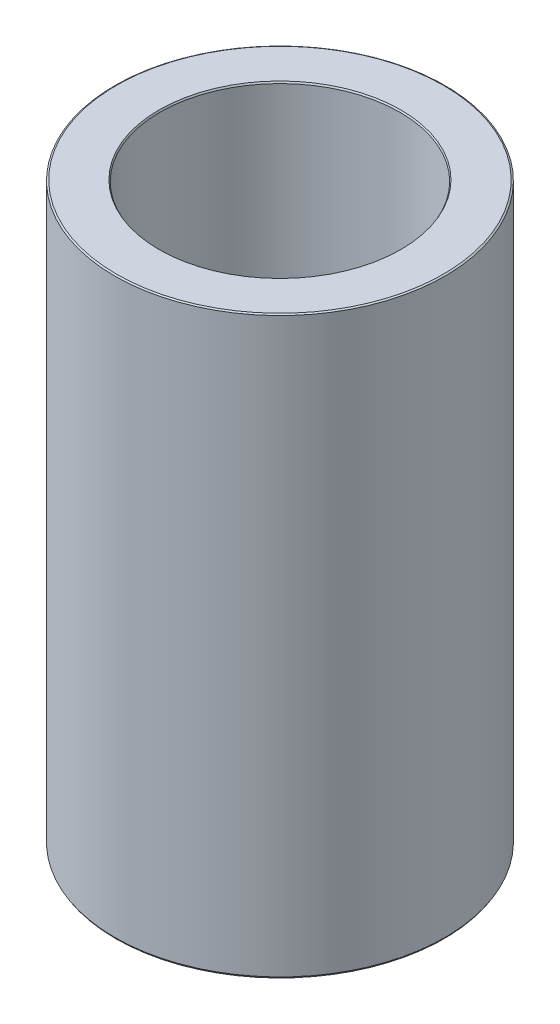
ISO-10303-21;
HEADER;
FILE_DESCRIPTION(('STEP AP214'),'2;1');
FILE_NAME('part.step','',(''),(''),'','','');
FILE_SCHEMA(('AUTOMOTIVE_DESIGN { 1 0 10303 214 1 1 1 1 }'));
ENDSEC;
DATA;
#1=APPLICATION_CONTEXT('core data for automotive mechanical design processes');
#2=APPLICATION_PROTOCOL_DEFINITION('international standard','automotive_design',2000,#1);
#3=PRODUCT_CONTEXT('',#1,'mechanical');
#4=PRODUCT('Part','Part','',(#3));
#5=PRODUCT_RELATED_PRODUCT_CATEGORY('part','',(#4));
#6=PRODUCT_DEFINITION_FORMATION('','',#4);
#7=PRODUCT_DEFINITION_CONTEXT('part definition',#1,'design');
#8=PRODUCT_DEFINITION('design','',#6,#7);
#9=PRODUCT_DEFINITION_SHAPE('','',#8);
#10=(LENGTH_UNIT() NAMED_UNIT(*) SI_UNIT(.MILLI.,.METRE.));
#11=(NAMED_UNIT(*) PLANE_ANGLE_UNIT() SI_UNIT($,.RADIAN.));
#12=(NAMED_UNIT(*) SI_UNIT($,.STERADIAN.) SOLID_ANGLE_UNIT());
#13=UNCERTAINTY_MEASURE_WITH_UNIT(LENGTH_MEASURE(1.E-05),#10,'distance_accuracy_value','');
#14=(GEOMETRIC_REPRESENTATION_CONTEXT(3) GLOBAL_UNCERTAINTY_ASSIGNED_CONTEXT((#13)) GLOBAL_UNIT_ASSIGNED_CONTEXT((#10,
#11,#12)) REPRESENTATION_CONTEXT('',''));
#15=CARTESIAN_POINT('',(0.,0.,0.));
#16=DIRECTION('',(0.,0.,1.));
#17=DIRECTION('',(1.,0.,0.));
#18=AXIS2_PLACEMENT_3D('',#15,#16,#17);
#19=CARTESIAN_POINT('',(0.,182.937425126401,0.));
#20=DIRECTION('',(0.,-1.,0.));
#21=DIRECTION('',(0.,0.,-1.));
#22=AXIS2_PLACEMENT_3D('',#19,#20,#21);
#23=CYLINDRICAL_SURFACE('',#22,52.5);
#24=CARTESIAN_POINT('',(0.,0.502531123338923,0.));
#25=DIRECTION('',(0.,1.,0.));
#26=DIRECTION('',(0.,0.,1.));
#27=AXIS2_PLACEMENT_3D('',#24,#25,#26);
#28=CIRCLE('',#27,52.5);
#29=CARTESIAN_POINT('',(0.,0.502531123338923,52.5));
#30=VERTEX_POINT('',#29);
#31=EDGE_CURVE('E10',#30,#30,#28,.T.);
#32=ORIENTED_EDGE('',*,*,#31,.T.);
#33=EDGE_LOOP('',(#32));
#34=FACE_BOUND('',#33,.T.);
#35=CARTESIAN_POINT('',(0.,182.647288647065,0.));
#36=DIRECTION('',(0.,1.,0.));
#37=DIRECTION('',(0.,0.,1.));
#38=AXIS2_PLACEMENT_3D('',#35,#36,#37);
#39=CIRCLE('',#38,52.5);
#40=CARTESIAN_POINT('',(0.,182.647288647065,52.5));
#41=VERTEX_POINT('',#40);
#42=EDGE_CURVE('E50',#41,#41,#39,.F.);
#43=ORIENTED_EDGE('',*,*,#42,.T.);
#44=EDGE_LOOP('',(#43));
#45=FACE_BOUND('',#44,.T.);
#46=ADVANCED_FACE('F39',(#34,#45),#23,.T.);
#47=CARTESIAN_POINT('',(0.,182.937425126401,0.));
#48=DIRECTION('',(0.,1.,0.));
#49=DIRECTION('',(0.,0.,1.));
#50=AXIS2_PLACEMENT_3D('',#47,#48,#49);
#51=PLANE('',#50);
#52=CARTESIAN_POINT('',(0.,182.937425126401,0.));
#53=DIRECTION('',(0.,1.,0.));
#54=DIRECTION('',(0.,0.,1.));
#55=AXIS2_PLACEMENT_3D('',#52,#53,#54);
#56=CIRCLE('',#55,38.4630428898458);
#57=CARTESIAN_POINT('',(0.,182.937425126401,38.4630428898458));
#58=VERTEX_POINT('',#57);
#59=EDGE_CURVE('E58',#58,#58,#56,.F.);
#60=ORIENTED_EDGE('',*,*,#59,.T.);
#61=EDGE_LOOP('',(#60));
#62=FACE_BOUND('',#61,.T.);
#63=CARTESIAN_POINT('',(0.,182.937425126401,0.));
#64=DIRECTION('',(0.,1.,0.));
#65=DIRECTION('',(0.,0.,1.));
#66=AXIS2_PLACEMENT_3D('',#63,#64,#65);
#67=CIRCLE('',#66,51.9974688766612);
#68=CARTESIAN_POINT('',(0.,182.937425126401,51.9974688766612));
#69=VERTEX_POINT('',#68);
#70=EDGE_CURVE('E61',#69,#69,#67,.T.);
#71=ORIENTED_EDGE('',*,*,#70,.T.);
#72=EDGE_LOOP('',(#71));
#73=FACE_BOUND('',#72,.T.);
#74=ADVANCED_FACE('F88',(#62,#73),#51,.T.);
#75=CARTESIAN_POINT('',(0.,0.,0.));
#76=DIRECTION('',(0.,1.,0.));
#77=DIRECTION('',(0.,0.,1.));
#78=AXIS2_PLACEMENT_3D('',#75,#76,#77);
#79=PLANE('',#78);
#80=CARTESIAN_POINT('',(0.,0.,0.));
#81=DIRECTION('',(0.,1.,0.));
#82=DIRECTION('',(0.,0.,1.));
#83=AXIS2_PLACEMENT_3D('',#80,#81,#82);
#84=CIRCLE('',#83,38.6754375338488);
#85=CARTESIAN_POINT('',(0.,0.,38.6754375338488));
#86=VERTEX_POINT('',#85);
#87=EDGE_CURVE('E51',#86,#86,#84,.T.);
#88=ORIENTED_EDGE('',*,*,#87,.T.);
#89=EDGE_LOOP('',(#88));
#90=FACE_BOUND('',#89,.T.);
#91=CARTESIAN_POINT('',(0.,0.,0.));
#92=DIRECTION('',(0.,1.,0.));
#93=DIRECTION('',(0.,0.,1.));
#94=AXIS2_PLACEMENT_3D('',#91,#92,#93);
#95=CIRCLE('',#94,52.2098635206641);
#96=CARTESIAN_POINT('',(0.,0.,52.2098635206641));
#97=VERTEX_POINT('',#96);
#98=EDGE_CURVE('E54',#97,#97,#95,.F.);
#99=ORIENTED_EDGE('',*,*,#98,.T.);
#100=EDGE_LOOP('',(#99));
#101=FACE_BOUND('',#100,.T.);
#102=ADVANCED_FACE('F83',(#90,#101),#79,.F.);
#103=CARTESIAN_POINT('',(0.,182.937425126401,0.));
#104=DIRECTION('',(0.,-1.,0.));
#105=DIRECTION('',(0.,0.,-1.));
#106=AXIS2_PLACEMENT_3D('',#103,#104,#105);
#107=CYLINDRICAL_SURFACE('',#106,38.1729064105099);
#108=CARTESIAN_POINT('',(0.,182.434894003062,0.));
#109=DIRECTION('',(0.,1.,0.));
#110=DIRECTION('',(0.,0.,1.));
#111=AXIS2_PLACEMENT_3D('',#108,#109,#110);
#112=CIRCLE('',#111,38.1729064105099);
#113=CARTESIAN_POINT('',(0.,182.434894003062,38.1729064105099));
#114=VERTEX_POINT('',#113);
#115=EDGE_CURVE('E67',#114,#114,#112,.T.);
#116=ORIENTED_EDGE('',*,*,#115,.T.);
#117=EDGE_LOOP('',(#116));
#118=FACE_BOUND('',#117,.T.);
#119=CARTESIAN_POINT('',(0.,0.290136479335873,0.));
#120=DIRECTION('',(0.,1.,0.));
#121=DIRECTION('',(0.,0.,1.));
#122=AXIS2_PLACEMENT_3D('',#119,#120,#121);
#123=CIRCLE('',#122,38.1729064105099);
#124=CARTESIAN_POINT('',(0.,0.290136479335873,38.1729064105099));
#125=VERTEX_POINT('',#124);
#126=EDGE_CURVE('E69',#125,#125,#123,.F.);
#127=ORIENTED_EDGE('',*,*,#126,.T.);
#128=EDGE_LOOP('',(#127));
#129=FACE_BOUND('',#128,.T.);
#130=ADVANCED_FACE('F71',(#118,#129),#107,.F.);
#131=CARTESIAN_POINT('',(0.,182.434894003062,0.));
#132=DIRECTION('',(0.,1.,0.));
#133=DIRECTION('',(0.,0.,1.));
#134=AXIS2_PLACEMENT_3D('',#131,#132,#133);
#135=CONICAL_SURFACE('',#134,38.1729064105099,0.523598775598264);
#136=ORIENTED_EDGE('',*,*,#59,.F.);
#137=EDGE_LOOP('',(#136));
#138=FACE_BOUND('',#137,.T.);
#139=ORIENTED_EDGE('',*,*,#115,.F.);
#140=EDGE_LOOP('',(#139));
#141=FACE_BOUND('',#140,.T.);
#142=ADVANCED_FACE('F77',(#138,#141),#135,.F.);
#143=CARTESIAN_POINT('',(0.,0.,0.));
#144=DIRECTION('',(0.,-1.,0.));
#145=DIRECTION('',(0.,0.,-1.));
#146=AXIS2_PLACEMENT_3D('',#143,#144,#145);
#147=CONICAL_SURFACE('',#146,38.6754375338488,1.04719755119659);
#148=ORIENTED_EDGE('',*,*,#126,.F.);
#149=EDGE_LOOP('',(#148));
#150=FACE_BOUND('',#149,.T.);
#151=ORIENTED_EDGE('',*,*,#87,.F.);
#152=EDGE_LOOP('',(#151));
#153=FACE_BOUND('',#152,.T.);
#154=ADVANCED_FACE('F73',(#150,#153),#147,.F.);
#155=CARTESIAN_POINT('',(0.,0.502531123338923,0.));
#156=DIRECTION('',(0.,1.,0.));
#157=DIRECTION('',(0.,0.,1.));
#158=AXIS2_PLACEMENT_3D('',#155,#156,#157);
#159=CONICAL_SURFACE('',#158,52.5,0.52359877559828);
#160=ORIENTED_EDGE('',*,*,#98,.F.);
#161=EDGE_LOOP('',(#160));
#162=FACE_BOUND('',#161,.T.);
#163=ORIENTED_EDGE('',*,*,#31,.F.);
#164=EDGE_LOOP('',(#163));
#165=FACE_BOUND('',#164,.T.);
#166=ADVANCED_FACE('F76',(#162,#165),#159,.T.);
#167=CARTESIAN_POINT('',(0.,182.937425126401,0.));
#168=DIRECTION('',(0.,-1.,0.));
#169=DIRECTION('',(0.,0.,-1.));
#170=AXIS2_PLACEMENT_3D('',#167,#168,#169);
#171=CONICAL_SURFACE('',#170,51.9974688766612,1.04719755119656);
#172=ORIENTED_EDGE('',*,*,#42,.F.);
#173=EDGE_LOOP('',(#172));
#174=FACE_BOUND('',#173,.T.);
#175=ORIENTED_EDGE('',*,*,#70,.F.);
#176=EDGE_LOOP('',(#175));
#177=FACE_BOUND('',#176,.T.);
#178=ADVANCED_FACE('F45',(#174,#177),#171,.T.);
#179=CLOSED_SHELL('',(#46,#74,#102,#130,#142,#154,#166,#178));
#180=MANIFOLD_SOLID_BREP('B2',#179);
#181=ADVANCED_BREP_SHAPE_REPRESENTATION('',(#18,#180),#14);
#182=SHAPE_DEFINITION_REPRESENTATION(#9,#181);
ENDSEC;
END-ISO-10303-21;
